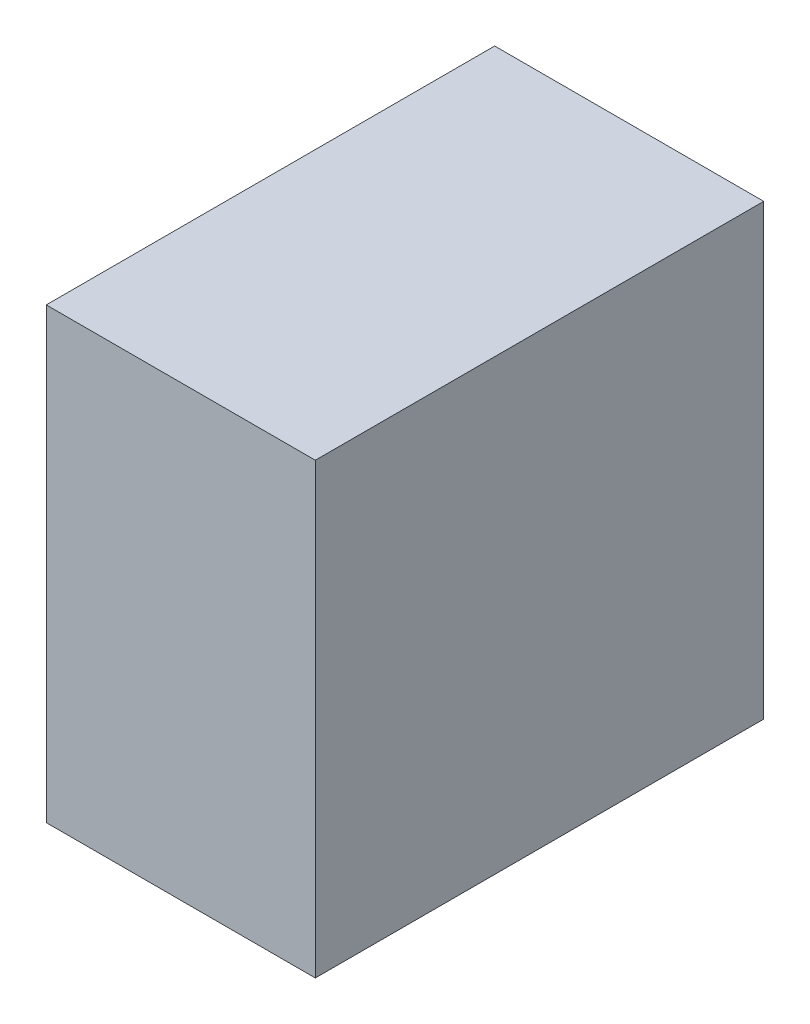
ISO-10303-21;
HEADER;
FILE_DESCRIPTION(('STEP AP214'),'2;1');
FILE_NAME('part.step','',(''),(''),'','','');
FILE_SCHEMA(('AUTOMOTIVE_DESIGN { 1 0 10303 214 1 1 1 1 }'));
ENDSEC;
DATA;
#1=APPLICATION_CONTEXT('core data for automotive mechanical design processes');
#2=APPLICATION_PROTOCOL_DEFINITION('international standard','automotive_design',2000,#1);
#3=PRODUCT_CONTEXT('',#1,'mechanical');
#4=PRODUCT('Part','Part','',(#3));
#5=PRODUCT_RELATED_PRODUCT_CATEGORY('part','',(#4));
#6=PRODUCT_DEFINITION_FORMATION('','',#4);
#7=PRODUCT_DEFINITION_CONTEXT('part definition',#1,'design');
#8=PRODUCT_DEFINITION('design','',#6,#7);
#9=PRODUCT_DEFINITION_SHAPE('','',#8);
#10=(LENGTH_UNIT() NAMED_UNIT(*) SI_UNIT(.MILLI.,.METRE.));
#11=(NAMED_UNIT(*) PLANE_ANGLE_UNIT() SI_UNIT($,.RADIAN.));
#12=(NAMED_UNIT(*) SI_UNIT($,.STERADIAN.) SOLID_ANGLE_UNIT());
#13=UNCERTAINTY_MEASURE_WITH_UNIT(LENGTH_MEASURE(1.E-05),#10,'distance_accuracy_value','');
#14=(GEOMETRIC_REPRESENTATION_CONTEXT(3) GLOBAL_UNCERTAINTY_ASSIGNED_CONTEXT((#13)) GLOBAL_UNIT_ASSIGNED_CONTEXT((#10,
#11,#12)) REPRESENTATION_CONTEXT('',''));
#15=CARTESIAN_POINT('',(0.,0.,0.));
#16=DIRECTION('',(0.,0.,1.));
#17=DIRECTION('',(1.,0.,0.));
#18=AXIS2_PLACEMENT_3D('',#15,#16,#17);
#19=CARTESIAN_POINT('',(30.,25.,-25.));
#20=DIRECTION('',(0.,0.,1.));
#21=DIRECTION('',(0.,-1.,0.));
#22=AXIS2_PLACEMENT_3D('',#19,#20,#21);
#23=PLANE('',#22);
#24=DIRECTION('',(0.,1.,0.));
#25=VECTOR('',#24,1.);
#26=CARTESIAN_POINT('',(0.,25.,-25.));
#27=LINE('',#26,#25);
#28=CARTESIAN_POINT('',(0.,-25.,-25.));
#29=VERTEX_POINT('',#28);
#30=CARTESIAN_POINT('',(0.,25.,-25.));
#31=VERTEX_POINT('',#30);
#32=EDGE_CURVE('E107',#29,#31,#27,.T.);
#33=ORIENTED_EDGE('',*,*,#32,.T.);
#34=DIRECTION('',(-1.,0.,0.));
#35=VECTOR('',#34,1.);
#36=CARTESIAN_POINT('',(30.,25.,-25.));
#37=LINE('',#36,#35);
#38=CARTESIAN_POINT('',(30.,25.,-25.));
#39=VERTEX_POINT('',#38);
#40=EDGE_CURVE('E11',#39,#31,#37,.T.);
#41=ORIENTED_EDGE('',*,*,#40,.F.);
#42=DIRECTION('',(0.,1.,0.));
#43=VECTOR('',#42,1.);
#44=CARTESIAN_POINT('',(30.,25.,-25.));
#45=LINE('',#44,#43);
#46=CARTESIAN_POINT('',(30.,-25.,-25.));
#47=VERTEX_POINT('',#46);
#48=EDGE_CURVE('E91',#47,#39,#45,.T.);
#49=ORIENTED_EDGE('',*,*,#48,.F.);
#50=DIRECTION('',(-1.,0.,0.));
#51=VECTOR('',#50,1.);
#52=CARTESIAN_POINT('',(30.,-25.,-25.));
#53=LINE('',#52,#51);
#54=EDGE_CURVE('E103',#47,#29,#53,.T.);
#55=ORIENTED_EDGE('',*,*,#54,.T.);
#56=EDGE_LOOP('',(#33,#41,#49,#55));
#57=FACE_BOUND('',#56,.T.);
#58=ADVANCED_FACE('F39',(#57),#23,.F.);
#59=CARTESIAN_POINT('',(30.,25.,25.));
#60=DIRECTION('',(0.,-1.,0.));
#61=DIRECTION('',(0.,0.,-1.));
#62=AXIS2_PLACEMENT_3D('',#59,#60,#61);
#63=PLANE('',#62);
#64=DIRECTION('',(0.,0.,1.));
#65=VECTOR('',#64,1.);
#66=CARTESIAN_POINT('',(0.,25.,25.));
#67=LINE('',#66,#65);
#68=CARTESIAN_POINT('',(0.,25.,25.));
#69=VERTEX_POINT('',#68);
#70=EDGE_CURVE('E96',#31,#69,#67,.T.);
#71=ORIENTED_EDGE('',*,*,#70,.T.);
#72=DIRECTION('',(-1.,0.,0.));
#73=VECTOR('',#72,1.);
#74=CARTESIAN_POINT('',(30.,25.,25.));
#75=LINE('',#74,#73);
#76=CARTESIAN_POINT('',(30.,25.,25.));
#77=VERTEX_POINT('',#76);
#78=EDGE_CURVE('E48',#77,#69,#75,.T.);
#79=ORIENTED_EDGE('',*,*,#78,.F.);
#80=DIRECTION('',(0.,0.,1.));
#81=VECTOR('',#80,1.);
#82=CARTESIAN_POINT('',(30.,25.,25.));
#83=LINE('',#82,#81);
#84=EDGE_CURVE('E86',#39,#77,#83,.T.);
#85=ORIENTED_EDGE('',*,*,#84,.F.);
#86=ORIENTED_EDGE('',*,*,#40,.T.);
#87=EDGE_LOOP('',(#71,#79,#85,#86));
#88=FACE_BOUND('',#87,.T.);
#89=ADVANCED_FACE('F95',(#88),#63,.F.);
#90=CARTESIAN_POINT('',(30.,25.,25.));
#91=DIRECTION('',(0.,0.,-1.));
#92=DIRECTION('',(0.,1.,0.));
#93=AXIS2_PLACEMENT_3D('',#90,#91,#92);
#94=PLANE('',#93);
#95=DIRECTION('',(0.,-1.,0.));
#96=VECTOR('',#95,1.);
#97=CARTESIAN_POINT('',(0.,25.,25.));
#98=LINE('',#97,#96);
#99=CARTESIAN_POINT('',(0.,-25.,25.));
#100=VERTEX_POINT('',#99);
#101=EDGE_CURVE('E73',#69,#100,#98,.T.);
#102=ORIENTED_EDGE('',*,*,#101,.T.);
#103=DIRECTION('',(-1.,0.,0.));
#104=VECTOR('',#103,1.);
#105=CARTESIAN_POINT('',(30.,-25.,25.));
#106=LINE('',#105,#104);
#107=CARTESIAN_POINT('',(30.,-25.,25.));
#108=VERTEX_POINT('',#107);
#109=EDGE_CURVE('E98',#108,#100,#106,.T.);
#110=ORIENTED_EDGE('',*,*,#109,.F.);
#111=DIRECTION('',(0.,-1.,0.));
#112=VECTOR('',#111,1.);
#113=CARTESIAN_POINT('',(30.,25.,25.));
#114=LINE('',#113,#112);
#115=EDGE_CURVE('E89',#77,#108,#114,.T.);
#116=ORIENTED_EDGE('',*,*,#115,.F.);
#117=ORIENTED_EDGE('',*,*,#78,.T.);
#118=EDGE_LOOP('',(#102,#110,#116,#117));
#119=FACE_BOUND('',#118,.T.);
#120=ADVANCED_FACE('F99',(#119),#94,.F.);
#121=CARTESIAN_POINT('',(30.,-25.,25.));
#122=DIRECTION('',(0.,1.,0.));
#123=DIRECTION('',(0.,0.,1.));
#124=AXIS2_PLACEMENT_3D('',#121,#122,#123);
#125=PLANE('',#124);
#126=DIRECTION('',(0.,0.,-1.));
#127=VECTOR('',#126,1.);
#128=CARTESIAN_POINT('',(0.,-25.,25.));
#129=LINE('',#128,#127);
#130=EDGE_CURVE('E79',#100,#29,#129,.T.);
#131=ORIENTED_EDGE('',*,*,#130,.T.);
#132=ORIENTED_EDGE('',*,*,#54,.F.);
#133=DIRECTION('',(0.,0.,-1.));
#134=VECTOR('',#133,1.);
#135=CARTESIAN_POINT('',(30.,-25.,25.));
#136=LINE('',#135,#134);
#137=EDGE_CURVE('E56',#108,#47,#136,.T.);
#138=ORIENTED_EDGE('',*,*,#137,.F.);
#139=ORIENTED_EDGE('',*,*,#109,.T.);
#140=EDGE_LOOP('',(#131,#132,#138,#139));
#141=FACE_BOUND('',#140,.T.);
#142=ADVANCED_FACE('F120',(#141),#125,.F.);
#143=CARTESIAN_POINT('',(30.,0.,0.));
#144=DIRECTION('',(1.,0.,0.));
#145=DIRECTION('',(0.,0.,-1.));
#146=AXIS2_PLACEMENT_3D('',#143,#144,#145);
#147=PLANE('',#146);
#148=ORIENTED_EDGE('',*,*,#48,.T.);
#149=ORIENTED_EDGE('',*,*,#84,.T.);
#150=ORIENTED_EDGE('',*,*,#115,.T.);
#151=ORIENTED_EDGE('',*,*,#137,.T.);
#152=EDGE_LOOP('',(#148,#149,#150,#151));
#153=FACE_BOUND('',#152,.T.);
#154=ADVANCED_FACE('F87',(#153),#147,.T.);
#155=CARTESIAN_POINT('',(0.,0.,0.));
#156=DIRECTION('',(1.,0.,0.));
#157=DIRECTION('',(0.,0.,-1.));
#158=AXIS2_PLACEMENT_3D('',#155,#156,#157);
#159=PLANE('',#158);
#160=ORIENTED_EDGE('',*,*,#32,.F.);
#161=ORIENTED_EDGE('',*,*,#130,.F.);
#162=ORIENTED_EDGE('',*,*,#101,.F.);
#163=ORIENTED_EDGE('',*,*,#70,.F.);
#164=EDGE_LOOP('',(#160,#161,#162,#163));
#165=FACE_BOUND('',#164,.T.);
#166=ADVANCED_FACE('F123',(#165),#159,.F.);
#167=CLOSED_SHELL('',(#58,#89,#120,#142,#154,#166));
#168=MANIFOLD_SOLID_BREP('B2',#167);
#169=ADVANCED_BREP_SHAPE_REPRESENTATION('',(#18,#168),#14);
#170=SHAPE_DEFINITION_REPRESENTATION(#9,#169);
ENDSEC;
END-ISO-10303-21;
